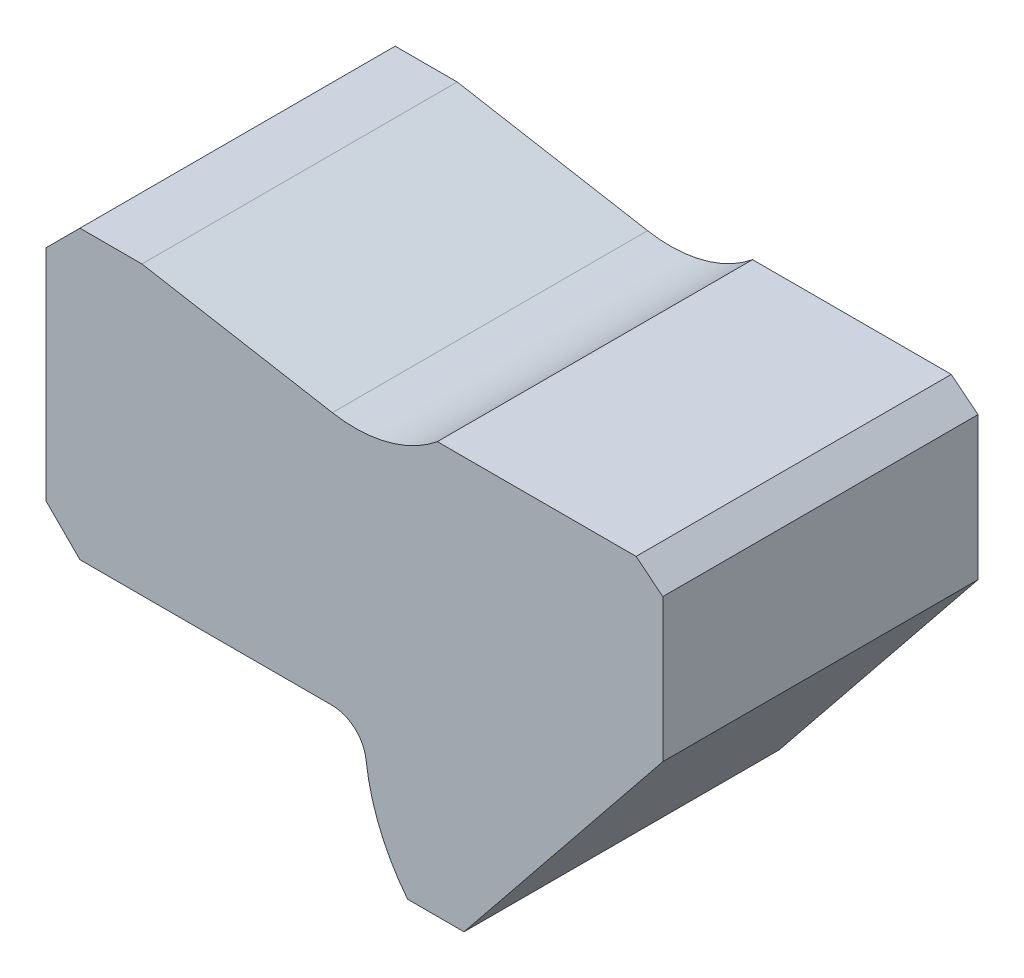
ISO-10303-21;
HEADER;
FILE_DESCRIPTION(('STEP AP214'),'2;1');
FILE_NAME('part.step','',(''),(''),'','','');
FILE_SCHEMA(('AUTOMOTIVE_DESIGN { 1 0 10303 214 1 1 1 1 }'));
ENDSEC;
DATA;
#1=APPLICATION_CONTEXT('core data for automotive mechanical design processes');
#2=APPLICATION_PROTOCOL_DEFINITION('international standard','automotive_design',2000,#1);
#3=PRODUCT_CONTEXT('',#1,'mechanical');
#4=PRODUCT('Part','Part','',(#3));
#5=PRODUCT_RELATED_PRODUCT_CATEGORY('part','',(#4));
#6=PRODUCT_DEFINITION_FORMATION('','',#4);
#7=PRODUCT_DEFINITION_CONTEXT('part definition',#1,'design');
#8=PRODUCT_DEFINITION('design','',#6,#7);
#9=PRODUCT_DEFINITION_SHAPE('','',#8);
#10=(LENGTH_UNIT() NAMED_UNIT(*) SI_UNIT(.MILLI.,.METRE.));
#11=(NAMED_UNIT(*) PLANE_ANGLE_UNIT() SI_UNIT($,.RADIAN.));
#12=(NAMED_UNIT(*) SI_UNIT($,.STERADIAN.) SOLID_ANGLE_UNIT());
#13=UNCERTAINTY_MEASURE_WITH_UNIT(LENGTH_MEASURE(1.E-05),#10,'distance_accuracy_value','');
#14=(GEOMETRIC_REPRESENTATION_CONTEXT(3) GLOBAL_UNCERTAINTY_ASSIGNED_CONTEXT((#13)) GLOBAL_UNIT_ASSIGNED_CONTEXT((#10,
#11,#12)) REPRESENTATION_CONTEXT('',''));
#15=CARTESIAN_POINT('',(0.,0.,0.));
#16=DIRECTION('',(0.,0.,1.));
#17=DIRECTION('',(1.,0.,0.));
#18=AXIS2_PLACEMENT_3D('',#15,#16,#17);
#19=CARTESIAN_POINT('',(22.7376340018041,18.,46.));
#20=DIRECTION('',(0.,0.,-1.));
#21=DIRECTION('',(-1.,0.,0.));
#22=AXIS2_PLACEMENT_3D('',#19,#20,#21);
#23=CYLINDRICAL_SURFACE('',#22,29.);
#24=CARTESIAN_POINT('',(22.7376340018041,18.,0.));
#25=DIRECTION('',(0.,0.,1.));
#26=DIRECTION('',(1.,0.,0.));
#27=AXIS2_PLACEMENT_3D('',#24,#25,#26);
#28=CIRCLE('',#27,29.);
#29=CARTESIAN_POINT('',(-6.06097467277761,14.5882352941177,0.));
#30=VERTEX_POINT('',#29);
#31=CARTESIAN_POINT('',(0.,0.,0.));
#32=VERTEX_POINT('',#31);
#33=EDGE_CURVE('E180',#30,#32,#28,.T.);
#34=ORIENTED_EDGE('',*,*,#33,.T.);
#35=DIRECTION('',(0.,0.,-1.));
#36=VECTOR('',#35,1.);
#37=CARTESIAN_POINT('',(0.,0.,46.));
#38=LINE('',#37,#36);
#39=CARTESIAN_POINT('',(0.,0.,46.));
#40=VERTEX_POINT('',#39);
#41=EDGE_CURVE('E11',#40,#32,#38,.T.);
#42=ORIENTED_EDGE('',*,*,#41,.F.);
#43=CARTESIAN_POINT('',(22.7376340018041,18.,46.));
#44=DIRECTION('',(0.,0.,1.));
#45=DIRECTION('',(1.,0.,0.));
#46=AXIS2_PLACEMENT_3D('',#43,#44,#45);
#47=CIRCLE('',#46,29.);
#48=CARTESIAN_POINT('',(-6.06097467277761,14.5882352941177,46.));
#49=VERTEX_POINT('',#48);
#50=EDGE_CURVE('E220',#49,#40,#47,.T.);
#51=ORIENTED_EDGE('',*,*,#50,.F.);
#52=DIRECTION('',(0.,0.,-1.));
#53=VECTOR('',#52,1.);
#54=CARTESIAN_POINT('',(-6.06097467277761,14.5882352941177,46.));
#55=LINE('',#54,#53);
#56=EDGE_CURVE('E176',#49,#30,#55,.T.);
#57=ORIENTED_EDGE('',*,*,#56,.T.);
#58=EDGE_LOOP('',(#34,#42,#51,#57));
#59=FACE_BOUND('',#58,.T.);
#60=ADVANCED_FACE('F43',(#59),#23,.T.);
#61=CARTESIAN_POINT('',(0.,0.,46.));
#62=DIRECTION('',(0.,1.,0.));
#63=DIRECTION('',(-1.,0.,0.));
#64=AXIS2_PLACEMENT_3D('',#61,#62,#63);
#65=PLANE('',#64);
#66=DIRECTION('',(1.,0.,0.));
#67=VECTOR('',#66,1.);
#68=CARTESIAN_POINT('',(0.,0.,0.));
#69=LINE('',#68,#67);
#70=CARTESIAN_POINT('',(8.23763400180414,0.,0.));
#71=VERTEX_POINT('',#70);
#72=EDGE_CURVE('E184',#32,#71,#69,.T.);
#73=ORIENTED_EDGE('',*,*,#72,.T.);
#74=DIRECTION('',(0.,0.,-1.));
#75=VECTOR('',#74,1.);
#76=CARTESIAN_POINT('',(8.23763400180414,0.,46.));
#77=LINE('',#76,#75);
#78=CARTESIAN_POINT('',(8.23763400180414,0.,46.));
#79=VERTEX_POINT('',#78);
#80=EDGE_CURVE('E52',#79,#71,#77,.T.);
#81=ORIENTED_EDGE('',*,*,#80,.F.);
#82=DIRECTION('',(1.,0.,0.));
#83=VECTOR('',#82,1.);
#84=CARTESIAN_POINT('',(0.,0.,46.));
#85=LINE('',#84,#83);
#86=EDGE_CURVE('E121',#40,#79,#85,.T.);
#87=ORIENTED_EDGE('',*,*,#86,.F.);
#88=ORIENTED_EDGE('',*,*,#41,.T.);
#89=EDGE_LOOP('',(#73,#81,#87,#88));
#90=FACE_BOUND('',#89,.T.);
#91=ADVANCED_FACE('F328',(#90),#65,.F.);
#92=CARTESIAN_POINT('',(8.23763400180414,0.,46.));
#93=DIRECTION('',(-0.778753909083283,0.627329537872645,0.));
#94=DIRECTION('',(-0.627329537872645,-0.778753909083283,0.));
#95=AXIS2_PLACEMENT_3D('',#92,#93,#94);
#96=PLANE('',#95);
#97=DIRECTION('',(0.627329537872645,0.778753909083283,0.));
#98=VECTOR('',#97,1.);
#99=CARTESIAN_POINT('',(8.23763400180414,0.,0.));
#100=LINE('',#99,#98);
#101=CARTESIAN_POINT('',(37.2376340018041,36.,0.));
#102=VERTEX_POINT('',#101);
#103=EDGE_CURVE('E187',#71,#102,#100,.T.);
#104=ORIENTED_EDGE('',*,*,#103,.T.);
#105=DIRECTION('',(0.,0.,-1.));
#106=VECTOR('',#105,1.);
#107=CARTESIAN_POINT('',(37.2376340018041,36.,46.));
#108=LINE('',#107,#106);
#109=CARTESIAN_POINT('',(37.2376340018041,36.,46.));
#110=VERTEX_POINT('',#109);
#111=EDGE_CURVE('E255',#110,#102,#108,.T.);
#112=ORIENTED_EDGE('',*,*,#111,.F.);
#113=DIRECTION('',(0.627329537872645,0.778753909083283,0.));
#114=VECTOR('',#113,1.);
#115=CARTESIAN_POINT('',(8.23763400180414,0.,46.));
#116=LINE('',#115,#114);
#117=EDGE_CURVE('E265',#79,#110,#116,.T.);
#118=ORIENTED_EDGE('',*,*,#117,.F.);
#119=ORIENTED_EDGE('',*,*,#80,.T.);
#120=EDGE_LOOP('',(#104,#112,#118,#119));
#121=FACE_BOUND('',#120,.T.);
#122=ADVANCED_FACE('F263',(#121),#96,.F.);
#123=CARTESIAN_POINT('',(37.2376340018041,36.,46.));
#124=DIRECTION('',(-1.,0.,0.));
#125=DIRECTION('',(0.,0.,1.));
#126=AXIS2_PLACEMENT_3D('',#123,#124,#125);
#127=PLANE('',#126);
#128=DIRECTION('',(0.,1.,0.));
#129=VECTOR('',#128,1.);
#130=CARTESIAN_POINT('',(37.2376340018041,36.,0.));
#131=LINE('',#130,#129);
#132=CARTESIAN_POINT('',(37.2376340018041,56.8633523106368,0.));
#133=VERTEX_POINT('',#132);
#134=EDGE_CURVE('E190',#102,#133,#131,.T.);
#135=ORIENTED_EDGE('',*,*,#134,.T.);
#136=DIRECTION('',(0.,0.,-1.));
#137=VECTOR('',#136,1.);
#138=CARTESIAN_POINT('',(37.2376340018041,56.8633523106368,46.));
#139=LINE('',#138,#137);
#140=CARTESIAN_POINT('',(37.2376340018041,56.8633523106368,46.));
#141=VERTEX_POINT('',#140);
#142=EDGE_CURVE('E251',#141,#133,#139,.T.);
#143=ORIENTED_EDGE('',*,*,#142,.F.);
#144=DIRECTION('',(0.,1.,0.));
#145=VECTOR('',#144,1.);
#146=CARTESIAN_POINT('',(37.2376340018041,36.,46.));
#147=LINE('',#146,#145);
#148=EDGE_CURVE('E284',#110,#141,#147,.T.);
#149=ORIENTED_EDGE('',*,*,#148,.F.);
#150=ORIENTED_EDGE('',*,*,#111,.T.);
#151=EDGE_LOOP('',(#135,#143,#149,#150));
#152=FACE_BOUND('',#151,.T.);
#153=ADVANCED_FACE('F274',(#152),#127,.F.);
#154=CARTESIAN_POINT('',(37.2376340018041,56.8633523106368,46.));
#155=DIRECTION('',(-0.627329537872645,-0.778753909083282,0.));
#156=DIRECTION('',(0.778753909083282,-0.627329537872645,0.));
#157=AXIS2_PLACEMENT_3D('',#154,#155,#156);
#158=PLANE('',#157);
#159=DIRECTION('',(-0.778753909083282,0.627329537872645,0.));
#160=VECTOR('',#159,1.);
#161=CARTESIAN_POINT('',(37.2376340018041,56.8633523106368,0.));
#162=LINE('',#161,#160);
#163=CARTESIAN_POINT('',(33.3438644563877,60.,0.));
#164=VERTEX_POINT('',#163);
#165=EDGE_CURVE('E193',#133,#164,#162,.T.);
#166=ORIENTED_EDGE('',*,*,#165,.T.);
#167=DIRECTION('',(0.,0.,-1.));
#168=VECTOR('',#167,1.);
#169=CARTESIAN_POINT('',(33.3438644563877,60.,46.));
#170=LINE('',#169,#168);
#171=CARTESIAN_POINT('',(33.3438644563877,60.,46.));
#172=VERTEX_POINT('',#171);
#173=EDGE_CURVE('E247',#172,#164,#170,.T.);
#174=ORIENTED_EDGE('',*,*,#173,.F.);
#175=DIRECTION('',(-0.778753909083282,0.627329537872645,0.));
#176=VECTOR('',#175,1.);
#177=CARTESIAN_POINT('',(37.2376340018041,56.8633523106368,46.));
#178=LINE('',#177,#176);
#179=EDGE_CURVE('E280',#141,#172,#178,.T.);
#180=ORIENTED_EDGE('',*,*,#179,.F.);
#181=ORIENTED_EDGE('',*,*,#142,.T.);
#182=EDGE_LOOP('',(#166,#174,#180,#181));
#183=FACE_BOUND('',#182,.T.);
#184=ADVANCED_FACE('F278',(#183),#158,.F.);
#185=CARTESIAN_POINT('',(33.3438644563877,60.,46.));
#186=DIRECTION('',(0.,-1.,0.));
#187=DIRECTION('',(0.,0.,-1.));
#188=AXIS2_PLACEMENT_3D('',#185,#186,#187);
#189=PLANE('',#188);
#190=DIRECTION('',(-1.,0.,0.));
#191=VECTOR('',#190,1.);
#192=CARTESIAN_POINT('',(33.3438644563877,60.,0.));
#193=LINE('',#192,#191);
#194=CARTESIAN_POINT('',(4.34386445638773,60.,0.));
#195=VERTEX_POINT('',#194);
#196=EDGE_CURVE('E196',#164,#195,#193,.T.);
#197=ORIENTED_EDGE('',*,*,#196,.T.);
#198=DIRECTION('',(0.,0.,-1.));
#199=VECTOR('',#198,1.);
#200=CARTESIAN_POINT('',(4.34386445638773,60.,46.));
#201=LINE('',#200,#199);
#202=CARTESIAN_POINT('',(4.34386445638773,60.,46.));
#203=VERTEX_POINT('',#202);
#204=EDGE_CURVE('E243',#203,#195,#201,.T.);
#205=ORIENTED_EDGE('',*,*,#204,.F.);
#206=DIRECTION('',(-1.,0.,0.));
#207=VECTOR('',#206,1.);
#208=CARTESIAN_POINT('',(33.3438644563877,60.,46.));
#209=LINE('',#208,#207);
#210=EDGE_CURVE('E283',#172,#203,#209,.T.);
#211=ORIENTED_EDGE('',*,*,#210,.F.);
#212=ORIENTED_EDGE('',*,*,#173,.T.);
#213=EDGE_LOOP('',(#197,#205,#211,#212));
#214=FACE_BOUND('',#213,.T.);
#215=ADVANCED_FACE('F341',(#214),#189,.F.);
#216=CARTESIAN_POINT('',(-7.67950337872271,74.7118532449733,46.));
#217=DIRECTION('',(0.,0.,-1.));
#218=DIRECTION('',(-1.,0.,0.));
#219=AXIS2_PLACEMENT_3D('',#216,#217,#218);
#220=CYLINDRICAL_SURFACE('',#219,19.);
#221=CARTESIAN_POINT('',(-7.67950337872271,74.7118532449733,0.));
#222=DIRECTION('',(0.,0.,-1.));
#223=DIRECTION('',(-1.,0.,0.));
#224=AXIS2_PLACEMENT_3D('',#221,#222,#223);
#225=CIRCLE('',#224,19.);
#226=CARTESIAN_POINT('',(-10.9788187543942,56.0005059377413,0.));
#227=VERTEX_POINT('',#226);
#228=EDGE_CURVE('E199',#195,#227,#225,.T.);
#229=ORIENTED_EDGE('',*,*,#228,.T.);
#230=DIRECTION('',(0.,0.,-1.));
#231=VECTOR('',#230,1.);
#232=CARTESIAN_POINT('',(-10.9788187543942,56.0005059377413,46.));
#233=LINE('',#232,#231);
#234=CARTESIAN_POINT('',(-10.9788187543942,56.0005059377413,46.));
#235=VERTEX_POINT('',#234);
#236=EDGE_CURVE('E239',#235,#227,#233,.T.);
#237=ORIENTED_EDGE('',*,*,#236,.F.);
#238=CARTESIAN_POINT('',(-7.67950337872271,74.7118532449733,46.));
#239=DIRECTION('',(0.,0.,-1.));
#240=DIRECTION('',(-1.,0.,0.));
#241=AXIS2_PLACEMENT_3D('',#238,#239,#240);
#242=CIRCLE('',#241,19.);
#243=EDGE_CURVE('E288',#203,#235,#242,.T.);
#244=ORIENTED_EDGE('',*,*,#243,.F.);
#245=ORIENTED_EDGE('',*,*,#204,.T.);
#246=EDGE_LOOP('',(#229,#237,#244,#245));
#247=FACE_BOUND('',#246,.T.);
#248=ADVANCED_FACE('F344',(#247),#220,.F.);
#249=CARTESIAN_POINT('',(-38.7623659981959,60.8994949366117,46.));
#250=DIRECTION('',(-0.173648177666924,-0.984807753012209,0.));
#251=DIRECTION('',(0.984807753012209,-0.173648177666924,0.));
#252=AXIS2_PLACEMENT_3D('',#249,#250,#251);
#253=PLANE('',#252);
#254=DIRECTION('',(-0.984807753012209,0.173648177666924,0.));
#255=VECTOR('',#254,1.);
#256=CARTESIAN_POINT('',(-38.7623659981959,60.8994949366117,0.));
#257=LINE('',#256,#255);
#258=CARTESIAN_POINT('',(-38.7623659981959,60.8994949366117,0.));
#259=VERTEX_POINT('',#258);
#260=EDGE_CURVE('E202',#227,#259,#257,.T.);
#261=ORIENTED_EDGE('',*,*,#260,.T.);
#262=DIRECTION('',(0.,0.,-1.));
#263=VECTOR('',#262,1.);
#264=CARTESIAN_POINT('',(-38.7623659981959,60.8994949366117,46.));
#265=LINE('',#264,#263);
#266=CARTESIAN_POINT('',(-38.7623659981959,60.8994949366117,46.));
#267=VERTEX_POINT('',#266);
#268=EDGE_CURVE('E235',#267,#259,#265,.T.);
#269=ORIENTED_EDGE('',*,*,#268,.F.);
#270=DIRECTION('',(-0.984807753012209,0.173648177666924,0.));
#271=VECTOR('',#270,1.);
#272=CARTESIAN_POINT('',(-38.7623659981959,60.8994949366117,46.));
#273=LINE('',#272,#271);
#274=EDGE_CURVE('E295',#235,#267,#273,.T.);
#275=ORIENTED_EDGE('',*,*,#274,.F.);
#276=ORIENTED_EDGE('',*,*,#236,.T.);
#277=EDGE_LOOP('',(#261,#269,#275,#276));
#278=FACE_BOUND('',#277,.T.);
#279=ADVANCED_FACE('F348',(#278),#253,.F.);
#280=CARTESIAN_POINT('',(-38.7623659981959,60.8994949366117,46.));
#281=DIRECTION('',(0.,-1.,0.));
#282=DIRECTION('',(0.,0.,-1.));
#283=AXIS2_PLACEMENT_3D('',#280,#281,#282);
#284=PLANE('',#283);
#285=DIRECTION('',(-1.,0.,0.));
#286=VECTOR('',#285,1.);
#287=CARTESIAN_POINT('',(-38.7623659981959,60.8994949366117,0.));
#288=LINE('',#287,#286);
#289=CARTESIAN_POINT('',(-47.81261852989,60.8994949366117,0.));
#290=VERTEX_POINT('',#289);
#291=EDGE_CURVE('E205',#259,#290,#288,.T.);
#292=ORIENTED_EDGE('',*,*,#291,.T.);
#293=DIRECTION('',(0.,0.,-1.));
#294=VECTOR('',#293,1.);
#295=CARTESIAN_POINT('',(-47.81261852989,60.8994949366117,46.));
#296=LINE('',#295,#294);
#297=CARTESIAN_POINT('',(-47.81261852989,60.8994949366117,46.));
#298=VERTEX_POINT('',#297);
#299=EDGE_CURVE('E231',#298,#290,#296,.T.);
#300=ORIENTED_EDGE('',*,*,#299,.F.);
#301=DIRECTION('',(-1.,0.,0.));
#302=VECTOR('',#301,1.);
#303=CARTESIAN_POINT('',(-38.7623659981959,60.8994949366117,46.));
#304=LINE('',#303,#302);
#305=EDGE_CURVE('E298',#267,#298,#304,.T.);
#306=ORIENTED_EDGE('',*,*,#305,.F.);
#307=ORIENTED_EDGE('',*,*,#268,.T.);
#308=EDGE_LOOP('',(#292,#300,#306,#307));
#309=FACE_BOUND('',#308,.T.);
#310=ADVANCED_FACE('F352',(#309),#284,.F.);
#311=CARTESIAN_POINT('',(-47.81261852989,60.8994949366117,46.));
#312=DIRECTION('',(0.70710678118655,-0.707106781186545,0.));
#313=DIRECTION('',(0.707106781186545,0.70710678118655,0.));
#314=AXIS2_PLACEMENT_3D('',#311,#312,#313);
#315=PLANE('',#314);
#316=DIRECTION('',(-0.707106781186545,-0.70710678118655,0.));
#317=VECTOR('',#316,1.);
#318=CARTESIAN_POINT('',(-47.81261852989,60.8994949366117,0.));
#319=LINE('',#318,#317);
#320=CARTESIAN_POINT('',(-52.7623659981959,55.9497474683058,0.));
#321=VERTEX_POINT('',#320);
#322=EDGE_CURVE('E208',#290,#321,#319,.T.);
#323=ORIENTED_EDGE('',*,*,#322,.T.);
#324=DIRECTION('',(0.,0.,-1.));
#325=VECTOR('',#324,1.);
#326=CARTESIAN_POINT('',(-52.7623659981959,55.9497474683058,46.));
#327=LINE('',#326,#325);
#328=CARTESIAN_POINT('',(-52.7623659981959,55.9497474683058,46.));
#329=VERTEX_POINT('',#328);
#330=EDGE_CURVE('E227',#329,#321,#327,.T.);
#331=ORIENTED_EDGE('',*,*,#330,.F.);
#332=DIRECTION('',(-0.707106781186545,-0.70710678118655,0.));
#333=VECTOR('',#332,1.);
#334=CARTESIAN_POINT('',(-47.81261852989,60.8994949366117,46.));
#335=LINE('',#334,#333);
#336=EDGE_CURVE('E301',#298,#329,#335,.T.);
#337=ORIENTED_EDGE('',*,*,#336,.F.);
#338=ORIENTED_EDGE('',*,*,#299,.T.);
#339=EDGE_LOOP('',(#323,#331,#337,#338));
#340=FACE_BOUND('',#339,.T.);
#341=ADVANCED_FACE('F309',(#340),#315,.F.);
#342=CARTESIAN_POINT('',(-52.7623659981959,55.9497474683058,46.));
#343=DIRECTION('',(1.,0.,0.));
#344=DIRECTION('',(0.,1.,0.));
#345=AXIS2_PLACEMENT_3D('',#342,#343,#344);
#346=PLANE('',#345);
#347=DIRECTION('',(0.,-1.,0.));
#348=VECTOR('',#347,1.);
#349=CARTESIAN_POINT('',(-52.7623659981959,55.9497474683058,0.));
#350=LINE('',#349,#348);
#351=CARTESIAN_POINT('',(-52.7623659981958,23.9497474683058,0.));
#352=VERTEX_POINT('',#351);
#353=EDGE_CURVE('E211',#321,#352,#350,.T.);
#354=ORIENTED_EDGE('',*,*,#353,.T.);
#355=DIRECTION('',(0.,0.,-1.));
#356=VECTOR('',#355,1.);
#357=CARTESIAN_POINT('',(-52.7623659981958,23.9497474683058,46.));
#358=LINE('',#357,#356);
#359=CARTESIAN_POINT('',(-52.7623659981958,23.9497474683058,46.));
#360=VERTEX_POINT('',#359);
#361=EDGE_CURVE('E169',#360,#352,#358,.T.);
#362=ORIENTED_EDGE('',*,*,#361,.F.);
#363=DIRECTION('',(0.,-1.,0.));
#364=VECTOR('',#363,1.);
#365=CARTESIAN_POINT('',(-52.7623659981959,55.9497474683058,46.));
#366=LINE('',#365,#364);
#367=EDGE_CURVE('E158',#329,#360,#366,.T.);
#368=ORIENTED_EDGE('',*,*,#367,.F.);
#369=ORIENTED_EDGE('',*,*,#330,.T.);
#370=EDGE_LOOP('',(#354,#362,#368,#369));
#371=FACE_BOUND('',#370,.T.);
#372=ADVANCED_FACE('F313',(#371),#346,.F.);
#373=CARTESIAN_POINT('',(-47.81261852989,19.,46.));
#374=DIRECTION('',(0.707106781186544,0.707106781186551,0.));
#375=DIRECTION('',(-0.707106781186551,0.707106781186544,0.));
#376=AXIS2_PLACEMENT_3D('',#373,#374,#375);
#377=PLANE('',#376);
#378=DIRECTION('',(0.707106781186551,-0.707106781186544,0.));
#379=VECTOR('',#378,1.);
#380=CARTESIAN_POINT('',(-47.81261852989,19.,0.));
#381=LINE('',#380,#379);
#382=CARTESIAN_POINT('',(-47.81261852989,19.,0.));
#383=VERTEX_POINT('',#382);
#384=EDGE_CURVE('E167',#352,#383,#381,.T.);
#385=ORIENTED_EDGE('',*,*,#384,.T.);
#386=DIRECTION('',(0.,0.,-1.));
#387=VECTOR('',#386,1.);
#388=CARTESIAN_POINT('',(-47.81261852989,19.,46.));
#389=LINE('',#388,#387);
#390=CARTESIAN_POINT('',(-47.81261852989,19.,46.));
#391=VERTEX_POINT('',#390);
#392=EDGE_CURVE('E164',#391,#383,#389,.T.);
#393=ORIENTED_EDGE('',*,*,#392,.F.);
#394=DIRECTION('',(0.707106781186551,-0.707106781186544,0.));
#395=VECTOR('',#394,1.);
#396=CARTESIAN_POINT('',(-47.81261852989,19.,46.));
#397=LINE('',#396,#395);
#398=EDGE_CURVE('E152',#360,#391,#397,.T.);
#399=ORIENTED_EDGE('',*,*,#398,.F.);
#400=ORIENTED_EDGE('',*,*,#361,.T.);
#401=EDGE_LOOP('',(#385,#393,#399,#400));
#402=FACE_BOUND('',#401,.T.);
#403=ADVANCED_FACE('F165',(#402),#377,.F.);
#404=CARTESIAN_POINT('',(-47.81261852989,19.,46.));
#405=DIRECTION('',(0.,1.,0.));
#406=DIRECTION('',(-1.,0.,0.));
#407=AXIS2_PLACEMENT_3D('',#404,#405,#406);
#408=PLANE('',#407);
#409=DIRECTION('',(1.,0.,0.));
#410=VECTOR('',#409,1.);
#411=CARTESIAN_POINT('',(-47.81261852989,19.,0.));
#412=LINE('',#411,#410);
#413=CARTESIAN_POINT('',(-11.0262520304641,19.,0.));
#414=VERTEX_POINT('',#413);
#415=EDGE_CURVE('E107',#383,#414,#412,.T.);
#416=ORIENTED_EDGE('',*,*,#415,.T.);
#417=DIRECTION('',(0.,0.,-1.));
#418=VECTOR('',#417,1.);
#419=CARTESIAN_POINT('',(-11.0262520304641,19.,46.));
#420=LINE('',#419,#418);
#421=CARTESIAN_POINT('',(-11.0262520304641,19.,46.));
#422=VERTEX_POINT('',#421);
#423=EDGE_CURVE('E170',#422,#414,#420,.T.);
#424=ORIENTED_EDGE('',*,*,#423,.F.);
#425=DIRECTION('',(1.,0.,0.));
#426=VECTOR('',#425,1.);
#427=CARTESIAN_POINT('',(-47.81261852989,19.,46.));
#428=LINE('',#427,#426);
#429=EDGE_CURVE('E156',#391,#422,#428,.T.);
#430=ORIENTED_EDGE('',*,*,#429,.F.);
#431=ORIENTED_EDGE('',*,*,#392,.T.);
#432=EDGE_LOOP('',(#416,#424,#430,#431));
#433=FACE_BOUND('',#432,.T.);
#434=ADVANCED_FACE('F172',(#433),#408,.F.);
#435=CARTESIAN_POINT('',(-11.0262520304641,14.,46.));
#436=DIRECTION('',(0.,0.,-1.));
#437=DIRECTION('',(-1.,0.,0.));
#438=AXIS2_PLACEMENT_3D('',#435,#436,#437);
#439=CYLINDRICAL_SURFACE('',#438,5.);
#440=CARTESIAN_POINT('',(-11.0262520304641,14.,0.));
#441=DIRECTION('',(0.,0.,-1.));
#442=DIRECTION('',(-1.,0.,0.));
#443=AXIS2_PLACEMENT_3D('',#440,#441,#442);
#444=CIRCLE('',#443,5.);
#445=EDGE_CURVE('E113',#414,#30,#444,.T.);
#446=ORIENTED_EDGE('',*,*,#445,.T.);
#447=ORIENTED_EDGE('',*,*,#56,.F.);
#448=CARTESIAN_POINT('',(-11.0262520304641,14.,46.));
#449=DIRECTION('',(0.,0.,-1.));
#450=DIRECTION('',(-1.,0.,0.));
#451=AXIS2_PLACEMENT_3D('',#448,#449,#450);
#452=CIRCLE('',#451,5.);
#453=EDGE_CURVE('E60',#422,#49,#452,.T.);
#454=ORIENTED_EDGE('',*,*,#453,.F.);
#455=ORIENTED_EDGE('',*,*,#423,.T.);
#456=EDGE_LOOP('',(#446,#447,#454,#455));
#457=FACE_BOUND('',#456,.T.);
#458=ADVANCED_FACE('F317',(#457),#439,.F.);
#459=CARTESIAN_POINT('',(22.7376340018041,18.,46.));
#460=DIRECTION('',(0.,0.,1.));
#461=DIRECTION('',(1.,0.,0.));
#462=AXIS2_PLACEMENT_3D('',#459,#460,#461);
#463=PLANE('',#462);
#464=ORIENTED_EDGE('',*,*,#50,.T.);
#465=ORIENTED_EDGE('',*,*,#86,.T.);
#466=ORIENTED_EDGE('',*,*,#117,.T.);
#467=ORIENTED_EDGE('',*,*,#148,.T.);
#468=ORIENTED_EDGE('',*,*,#179,.T.);
#469=ORIENTED_EDGE('',*,*,#210,.T.);
#470=ORIENTED_EDGE('',*,*,#243,.T.);
#471=ORIENTED_EDGE('',*,*,#274,.T.);
#472=ORIENTED_EDGE('',*,*,#305,.T.);
#473=ORIENTED_EDGE('',*,*,#336,.T.);
#474=ORIENTED_EDGE('',*,*,#367,.T.);
#475=ORIENTED_EDGE('',*,*,#398,.T.);
#476=ORIENTED_EDGE('',*,*,#429,.T.);
#477=ORIENTED_EDGE('',*,*,#453,.T.);
#478=EDGE_LOOP('',(#464,#465,#466,#467,#468,#469,#470,#471,#472,#473,#474,#475,#476,#477));
#479=FACE_BOUND('',#478,.T.);
#480=ADVANCED_FACE('F154',(#479),#463,.T.);
#481=CARTESIAN_POINT('',(22.7376340018041,18.,0.));
#482=DIRECTION('',(0.,0.,1.));
#483=DIRECTION('',(1.,0.,0.));
#484=AXIS2_PLACEMENT_3D('',#481,#482,#483);
#485=PLANE('',#484);
#486=ORIENTED_EDGE('',*,*,#33,.F.);
#487=ORIENTED_EDGE('',*,*,#445,.F.);
#488=ORIENTED_EDGE('',*,*,#415,.F.);
#489=ORIENTED_EDGE('',*,*,#384,.F.);
#490=ORIENTED_EDGE('',*,*,#353,.F.);
#491=ORIENTED_EDGE('',*,*,#322,.F.);
#492=ORIENTED_EDGE('',*,*,#291,.F.);
#493=ORIENTED_EDGE('',*,*,#260,.F.);
#494=ORIENTED_EDGE('',*,*,#228,.F.);
#495=ORIENTED_EDGE('',*,*,#196,.F.);
#496=ORIENTED_EDGE('',*,*,#165,.F.);
#497=ORIENTED_EDGE('',*,*,#134,.F.);
#498=ORIENTED_EDGE('',*,*,#103,.F.);
#499=ORIENTED_EDGE('',*,*,#72,.F.);
#500=EDGE_LOOP('',(#486,#487,#488,#489,#490,#491,#492,#493,#494,#495,#496,#497,#498,#499));
#501=FACE_BOUND('',#500,.T.);
#502=ADVANCED_FACE('F269',(#501),#485,.F.);
#503=CLOSED_SHELL('',(#60,#91,#122,#153,#184,#215,#248,#279,#310,#341,#372,#403,#434,#458,#480,#502));
#504=MANIFOLD_SOLID_BREP('B2',#503);
#505=ADVANCED_BREP_SHAPE_REPRESENTATION('',(#18,#504),#14);
#506=SHAPE_DEFINITION_REPRESENTATION(#9,#505);
ENDSEC;
END-ISO-10303-21;
